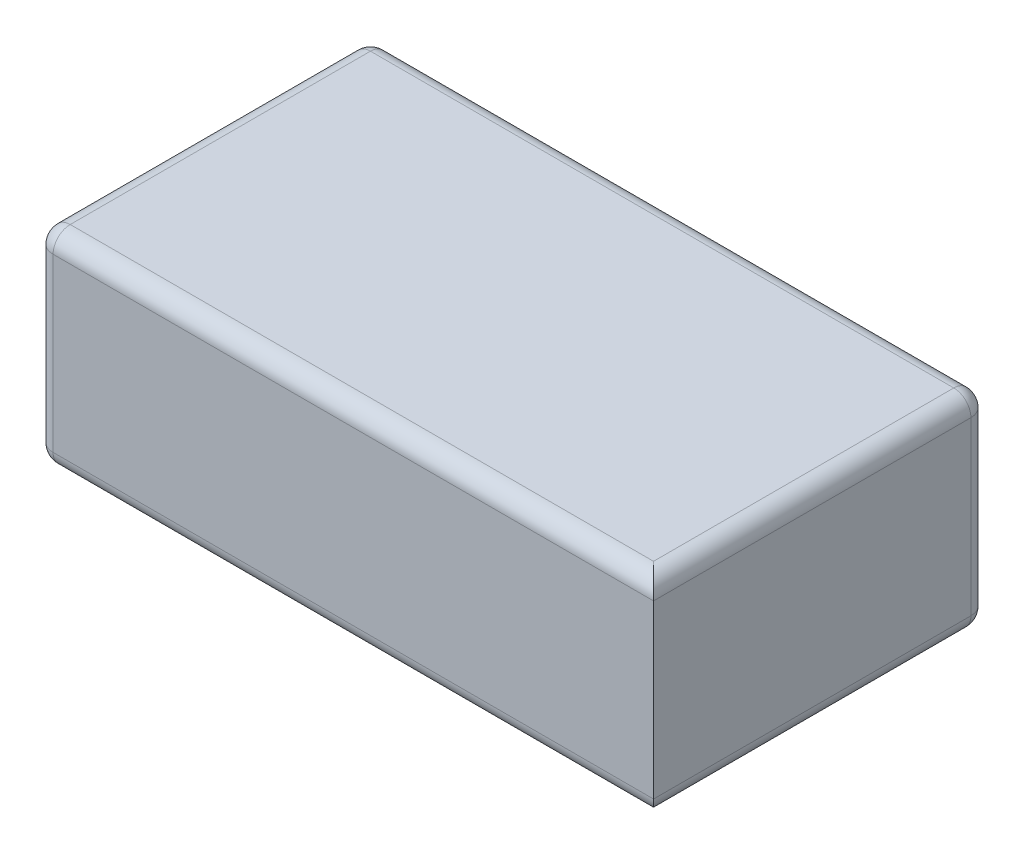
ISO-10303-21;
HEADER;
FILE_DESCRIPTION(('STEP AP214'),'2;1');
FILE_NAME('part.step','',(''),(''),'','','');
FILE_SCHEMA(('AUTOMOTIVE_DESIGN { 1 0 10303 214 1 1 1 1 }'));
ENDSEC;
DATA;
#1=APPLICATION_CONTEXT('core data for automotive mechanical design processes');
#2=APPLICATION_PROTOCOL_DEFINITION('international standard','automotive_design',2000,#1);
#3=PRODUCT_CONTEXT('',#1,'mechanical');
#4=PRODUCT('Part','Part','',(#3));
#5=PRODUCT_RELATED_PRODUCT_CATEGORY('part','',(#4));
#6=PRODUCT_DEFINITION_FORMATION('','',#4);
#7=PRODUCT_DEFINITION_CONTEXT('part definition',#1,'design');
#8=PRODUCT_DEFINITION('design','',#6,#7);
#9=PRODUCT_DEFINITION_SHAPE('','',#8);
#10=(LENGTH_UNIT() NAMED_UNIT(*) SI_UNIT(.MILLI.,.METRE.));
#11=(NAMED_UNIT(*) PLANE_ANGLE_UNIT() SI_UNIT($,.RADIAN.));
#12=(NAMED_UNIT(*) SI_UNIT($,.STERADIAN.) SOLID_ANGLE_UNIT());
#13=UNCERTAINTY_MEASURE_WITH_UNIT(LENGTH_MEASURE(1.E-05),#10,'distance_accuracy_value','');
#14=(GEOMETRIC_REPRESENTATION_CONTEXT(3) GLOBAL_UNCERTAINTY_ASSIGNED_CONTEXT((#13)) GLOBAL_UNIT_ASSIGNED_CONTEXT((#10,
#11,#12)) REPRESENTATION_CONTEXT('',''));
#15=CARTESIAN_POINT('',(0.,0.,0.));
#16=DIRECTION('',(0.,0.,1.));
#17=DIRECTION('',(1.,0.,0.));
#18=AXIS2_PLACEMENT_3D('',#15,#16,#17);
#19=CARTESIAN_POINT('',(0.,24.,0.));
#20=DIRECTION('',(1.,0.,0.));
#21=DIRECTION('',(0.,0.,-1.));
#22=AXIS2_PLACEMENT_3D('',#19,#20,#21);
#23=PLANE('',#22);
#24=DIRECTION('',(0.,-1.,0.));
#25=VECTOR('',#24,1.);
#26=CARTESIAN_POINT('',(0.,24.,-2.00000000000002));
#27=LINE('',#26,#25);
#28=CARTESIAN_POINT('',(0.,2.,-2.));
#29=VERTEX_POINT('',#28);
#30=CARTESIAN_POINT('',(0.,22.,-2.));
#31=VERTEX_POINT('',#30);
#32=EDGE_CURVE('E182',#29,#31,#27,.F.);
#33=ORIENTED_EDGE('',*,*,#32,.T.);
#34=DIRECTION('',(0.,0.,1.));
#35=VECTOR('',#34,1.);
#36=CARTESIAN_POINT('',(0.,22.,0.));
#37=LINE('',#36,#35);
#38=CARTESIAN_POINT('',(0.,21.9999999999999,-37.));
#39=VERTEX_POINT('',#38);
#40=EDGE_CURVE('E184',#31,#39,#37,.F.);
#41=ORIENTED_EDGE('',*,*,#40,.T.);
#42=DIRECTION('',(0.,-1.,0.));
#43=VECTOR('',#42,1.);
#44=CARTESIAN_POINT('',(0.,23.9999999999999,-37.));
#45=LINE('',#44,#43);
#46=CARTESIAN_POINT('',(0.,2.,-37.));
#47=VERTEX_POINT('',#46);
#48=EDGE_CURVE('E178',#39,#47,#45,.T.);
#49=ORIENTED_EDGE('',*,*,#48,.T.);
#50=DIRECTION('',(0.,0.,1.));
#51=VECTOR('',#50,1.);
#52=CARTESIAN_POINT('',(0.,2.,0.));
#53=LINE('',#52,#51);
#54=EDGE_CURVE('E180',#47,#29,#53,.T.);
#55=ORIENTED_EDGE('',*,*,#54,.T.);
#56=EDGE_LOOP('',(#33,#41,#49,#55));
#57=FACE_BOUND('',#56,.T.);
#58=ADVANCED_FACE('F36',(#57),#23,.F.);
#59=CARTESIAN_POINT('',(0.,24.,0.));
#60=DIRECTION('',(0.,0.,-1.));
#61=DIRECTION('',(-1.,0.,0.));
#62=AXIS2_PLACEMENT_3D('',#59,#60,#61);
#63=PLANE('',#62);
#64=DIRECTION('',(0.,-1.,0.));
#65=VECTOR('',#64,1.);
#66=CARTESIAN_POINT('',(1.99999999999998,24.,0.));
#67=LINE('',#66,#65);
#68=CARTESIAN_POINT('',(1.99999999999999,22.,0.));
#69=VERTEX_POINT('',#68);
#70=CARTESIAN_POINT('',(2.,2.,0.));
#71=VERTEX_POINT('',#70);
#72=EDGE_CURVE('E139',#69,#71,#67,.T.);
#73=ORIENTED_EDGE('',*,*,#72,.T.);
#74=DIRECTION('',(1.,0.,0.));
#75=VECTOR('',#74,1.);
#76=CARTESIAN_POINT('',(72.,2.,0.));
#77=LINE('',#76,#75);
#78=CARTESIAN_POINT('',(72.,2.,0.));
#79=VERTEX_POINT('',#78);
#80=EDGE_CURVE('E138',#71,#79,#77,.T.);
#81=ORIENTED_EDGE('',*,*,#80,.T.);
#82=DIRECTION('',(0.,-1.,0.));
#83=VECTOR('',#82,1.);
#84=CARTESIAN_POINT('',(72.,23.9999999999999,0.));
#85=LINE('',#84,#83);
#86=CARTESIAN_POINT('',(72.,21.9999999999999,0.));
#87=VERTEX_POINT('',#86);
#88=EDGE_CURVE('E122',#87,#79,#85,.T.);
#89=ORIENTED_EDGE('',*,*,#88,.F.);
#90=DIRECTION('',(1.,0.,0.));
#91=VECTOR('',#90,1.);
#92=CARTESIAN_POINT('',(0.,22.,0.));
#93=LINE('',#92,#91);
#94=EDGE_CURVE('E135',#87,#69,#93,.F.);
#95=ORIENTED_EDGE('',*,*,#94,.T.);
#96=EDGE_LOOP('',(#73,#81,#89,#95));
#97=FACE_BOUND('',#96,.T.);
#98=ADVANCED_FACE('F133',(#97),#63,.F.);
#99=CARTESIAN_POINT('',(72.,23.9999999999999,0.));
#100=DIRECTION('',(-1.,0.,0.));
#101=DIRECTION('',(0.,0.,1.));
#102=AXIS2_PLACEMENT_3D('',#99,#100,#101);
#103=PLANE('',#102);
#104=ORIENTED_EDGE('',*,*,#88,.T.);
#105=DIRECTION('',(0.,0.,-1.));
#106=VECTOR('',#105,1.);
#107=CARTESIAN_POINT('',(72.,2.,-39.));
#108=LINE('',#107,#106);
#109=CARTESIAN_POINT('',(72.,1.99999999999995,-37.));
#110=VERTEX_POINT('',#109);
#111=EDGE_CURVE('E129',#79,#110,#108,.T.);
#112=ORIENTED_EDGE('',*,*,#111,.T.);
#113=DIRECTION('',(0.,-1.,0.));
#114=VECTOR('',#113,1.);
#115=CARTESIAN_POINT('',(72.,23.9999999999999,-37.));
#116=LINE('',#115,#114);
#117=CARTESIAN_POINT('',(72.,21.9999999999999,-37.));
#118=VERTEX_POINT('',#117);
#119=EDGE_CURVE('E124',#110,#118,#116,.F.);
#120=ORIENTED_EDGE('',*,*,#119,.T.);
#121=DIRECTION('',(0.,0.,-1.));
#122=VECTOR('',#121,1.);
#123=CARTESIAN_POINT('',(72.,21.9999999999999,0.));
#124=LINE('',#123,#122);
#125=EDGE_CURVE('E119',#118,#87,#124,.F.);
#126=ORIENTED_EDGE('',*,*,#125,.T.);
#127=EDGE_LOOP('',(#104,#112,#120,#126));
#128=FACE_BOUND('',#127,.T.);
#129=ADVANCED_FACE('F121',(#128),#103,.F.);
#130=CARTESIAN_POINT('',(0.,23.9999999999999,-39.));
#131=DIRECTION('',(0.,0.,1.));
#132=DIRECTION('',(1.,0.,0.));
#133=AXIS2_PLACEMENT_3D('',#130,#131,#132);
#134=PLANE('',#133);
#135=DIRECTION('',(-1.,0.,0.));
#136=VECTOR('',#135,1.);
#137=CARTESIAN_POINT('',(0.,21.9999999999999,-39.));
#138=LINE('',#137,#136);
#139=CARTESIAN_POINT('',(2.,22.,-39.));
#140=VERTEX_POINT('',#139);
#141=CARTESIAN_POINT('',(70.,21.9999999999999,-39.));
#142=VERTEX_POINT('',#141);
#143=EDGE_CURVE('E45',#140,#142,#138,.F.);
#144=ORIENTED_EDGE('',*,*,#143,.T.);
#145=DIRECTION('',(0.,-1.,0.));
#146=VECTOR('',#145,1.);
#147=CARTESIAN_POINT('',(70.,23.9999999999999,-39.));
#148=LINE('',#147,#146);
#149=CARTESIAN_POINT('',(70.,2.,-39.));
#150=VERTEX_POINT('',#149);
#151=EDGE_CURVE('E11',#142,#150,#148,.T.);
#152=ORIENTED_EDGE('',*,*,#151,.T.);
#153=DIRECTION('',(-1.,0.,0.));
#154=VECTOR('',#153,1.);
#155=CARTESIAN_POINT('',(0.,2.,-39.));
#156=LINE('',#155,#154);
#157=CARTESIAN_POINT('',(2.,2.,-39.));
#158=VERTEX_POINT('',#157);
#159=EDGE_CURVE('E187',#150,#158,#156,.T.);
#160=ORIENTED_EDGE('',*,*,#159,.T.);
#161=DIRECTION('',(0.,-1.,0.));
#162=VECTOR('',#161,1.);
#163=CARTESIAN_POINT('',(2.,24.,-39.));
#164=LINE('',#163,#162);
#165=EDGE_CURVE('E56',#158,#140,#164,.F.);
#166=ORIENTED_EDGE('',*,*,#165,.T.);
#167=EDGE_LOOP('',(#144,#152,#160,#166));
#168=FACE_BOUND('',#167,.T.);
#169=ADVANCED_FACE('F251',(#168),#134,.F.);
#170=CARTESIAN_POINT('',(0.,23.9999999999999,-39.));
#171=DIRECTION('',(0.,-1.,0.));
#172=DIRECTION('',(0.,0.,-1.));
#173=AXIS2_PLACEMENT_3D('',#170,#171,#172);
#174=PLANE('',#173);
#175=DIRECTION('',(1.,0.,0.));
#176=VECTOR('',#175,1.);
#177=CARTESIAN_POINT('',(0.,24.,-2.00000000000002));
#178=LINE('',#177,#176);
#179=CARTESIAN_POINT('',(1.99999999999998,24.,-2.00000000000003));
#180=VERTEX_POINT('',#179);
#181=CARTESIAN_POINT('',(70.,23.9999999999999,-2.));
#182=VERTEX_POINT('',#181);
#183=EDGE_CURVE('E175',#180,#182,#178,.T.);
#184=ORIENTED_EDGE('',*,*,#183,.T.);
#185=DIRECTION('',(0.,0.,-1.));
#186=VECTOR('',#185,1.);
#187=CARTESIAN_POINT('',(70.,23.9999999999999,-39.));
#188=LINE('',#187,#186);
#189=CARTESIAN_POINT('',(70.,23.9999999999999,-37.));
#190=VERTEX_POINT('',#189);
#191=EDGE_CURVE('E146',#182,#190,#188,.T.);
#192=ORIENTED_EDGE('',*,*,#191,.T.);
#193=DIRECTION('',(-1.,0.,0.));
#194=VECTOR('',#193,1.);
#195=CARTESIAN_POINT('',(0.,23.9999999999999,-37.));
#196=LINE('',#195,#194);
#197=CARTESIAN_POINT('',(2.,23.9999999999999,-37.));
#198=VERTEX_POINT('',#197);
#199=EDGE_CURVE('E171',#190,#198,#196,.T.);
#200=ORIENTED_EDGE('',*,*,#199,.T.);
#201=DIRECTION('',(0.,0.,1.));
#202=VECTOR('',#201,1.);
#203=CARTESIAN_POINT('',(2.,24.,-39.));
#204=LINE('',#203,#202);
#205=EDGE_CURVE('E173',#198,#180,#204,.T.);
#206=ORIENTED_EDGE('',*,*,#205,.T.);
#207=EDGE_LOOP('',(#184,#192,#200,#206));
#208=FACE_BOUND('',#207,.T.);
#209=ADVANCED_FACE('F248',(#208),#174,.F.);
#210=CARTESIAN_POINT('',(0.,0.,-39.));
#211=DIRECTION('',(0.,-1.,0.));
#212=DIRECTION('',(0.,0.,-1.));
#213=AXIS2_PLACEMENT_3D('',#210,#211,#212);
#214=PLANE('',#213);
#215=DIRECTION('',(0.,0.,-1.));
#216=VECTOR('',#215,1.);
#217=CARTESIAN_POINT('',(70.,0.,0.));
#218=LINE('',#217,#216);
#219=CARTESIAN_POINT('',(70.,0.,-37.));
#220=VERTEX_POINT('',#219);
#221=CARTESIAN_POINT('',(70.,0.,-2.));
#222=VERTEX_POINT('',#221);
#223=EDGE_CURVE('E164',#220,#222,#218,.F.);
#224=ORIENTED_EDGE('',*,*,#223,.T.);
#225=DIRECTION('',(1.,0.,0.));
#226=VECTOR('',#225,1.);
#227=CARTESIAN_POINT('',(0.,0.,-2.00000000000001));
#228=LINE('',#227,#226);
#229=CARTESIAN_POINT('',(2.,0.,-2.00000000000001));
#230=VERTEX_POINT('',#229);
#231=EDGE_CURVE('E166',#222,#230,#228,.F.);
#232=ORIENTED_EDGE('',*,*,#231,.T.);
#233=DIRECTION('',(0.,0.,1.));
#234=VECTOR('',#233,1.);
#235=CARTESIAN_POINT('',(2.,0.,-39.));
#236=LINE('',#235,#234);
#237=CARTESIAN_POINT('',(2.,0.,-37.));
#238=VERTEX_POINT('',#237);
#239=EDGE_CURVE('E162',#230,#238,#236,.F.);
#240=ORIENTED_EDGE('',*,*,#239,.T.);
#241=DIRECTION('',(-1.,0.,0.));
#242=VECTOR('',#241,1.);
#243=CARTESIAN_POINT('',(72.,0.,-37.));
#244=LINE('',#243,#242);
#245=EDGE_CURVE('E157',#238,#220,#244,.F.);
#246=ORIENTED_EDGE('',*,*,#245,.T.);
#247=EDGE_LOOP('',(#224,#232,#240,#246));
#248=FACE_BOUND('',#247,.T.);
#249=ADVANCED_FACE('F250',(#248),#214,.T.);
#250=CARTESIAN_POINT('',(2.,21.9999999999999,-37.));
#251=DIRECTION('',(0.,0.,1.));
#252=DIRECTION('',(1.,0.,0.));
#253=AXIS2_PLACEMENT_3D('',#250,#251,#252);
#254=SPHERICAL_SURFACE('',#253,2.);
#255=CARTESIAN_POINT('',(2.,21.9999999999999,-37.));
#256=DIRECTION('',(0.,0.,-1.));
#257=DIRECTION('',(-1.,0.,0.));
#258=AXIS2_PLACEMENT_3D('',#255,#256,#257);
#259=CIRCLE('',#258,2.);
#260=EDGE_CURVE('E149',#198,#39,#259,.F.);
#261=ORIENTED_EDGE('',*,*,#260,.F.);
#262=CARTESIAN_POINT('',(2.,21.9999999999999,-37.));
#263=DIRECTION('',(-1.,0.,0.));
#264=DIRECTION('',(0.,0.,1.));
#265=AXIS2_PLACEMENT_3D('',#262,#263,#264);
#266=CIRCLE('',#265,2.);
#267=EDGE_CURVE('E40',#140,#198,#266,.F.);
#268=ORIENTED_EDGE('',*,*,#267,.F.);
#269=CARTESIAN_POINT('',(2.,21.9999999999999,-37.));
#270=DIRECTION('',(0.,1.,0.));
#271=DIRECTION('',(0.,0.,1.));
#272=AXIS2_PLACEMENT_3D('',#269,#270,#271);
#273=CIRCLE('',#272,2.);
#274=EDGE_CURVE('E232',#39,#140,#273,.F.);
#275=ORIENTED_EDGE('',*,*,#274,.F.);
#276=EDGE_LOOP('',(#261,#268,#275));
#277=FACE_BOUND('',#276,.T.);
#278=ADVANCED_FACE('F38',(#277),#254,.T.);
#279=CARTESIAN_POINT('',(70.,21.9999999999999,-39.));
#280=DIRECTION('',(0.,0.,-1.));
#281=DIRECTION('',(-1.,0.,0.));
#282=AXIS2_PLACEMENT_3D('',#279,#280,#281);
#283=CYLINDRICAL_SURFACE('',#282,2.);
#284=CARTESIAN_POINT('',(70.,21.9999999999999,-37.));
#285=DIRECTION('',(0.,0.,-1.));
#286=DIRECTION('',(-1.,0.,0.));
#287=AXIS2_PLACEMENT_3D('',#284,#285,#286);
#288=CIRCLE('',#287,2.);
#289=EDGE_CURVE('E150',#190,#118,#288,.T.);
#290=ORIENTED_EDGE('',*,*,#289,.F.);
#291=ORIENTED_EDGE('',*,*,#191,.F.);
#292=CARTESIAN_POINT('',(70.,21.9999999999999,-2.));
#293=DIRECTION('',(0.707106781186548,0.,-0.707106781186547));
#294=DIRECTION('',(0.707106781186547,0.,0.707106781186548));
#295=AXIS2_PLACEMENT_3D('',#292,#293,#294);
#296=ELLIPSE('',#295,2.82842712474619,2.);
#297=EDGE_CURVE('E143',#87,#182,#296,.F.);
#298=ORIENTED_EDGE('',*,*,#297,.F.);
#299=ORIENTED_EDGE('',*,*,#125,.F.);
#300=EDGE_LOOP('',(#290,#291,#298,#299));
#301=FACE_BOUND('',#300,.T.);
#302=ADVANCED_FACE('F144',(#301),#283,.T.);
#303=CARTESIAN_POINT('',(0.,21.9999999999999,-37.));
#304=DIRECTION('',(-1.,0.,0.));
#305=DIRECTION('',(0.,0.,1.));
#306=AXIS2_PLACEMENT_3D('',#303,#304,#305);
#307=CYLINDRICAL_SURFACE('',#306,2.);
#308=ORIENTED_EDGE('',*,*,#267,.T.);
#309=ORIENTED_EDGE('',*,*,#199,.F.);
#310=CARTESIAN_POINT('',(70.,21.9999999999999,-37.));
#311=DIRECTION('',(1.,0.,0.));
#312=DIRECTION('',(0.,0.,-1.));
#313=AXIS2_PLACEMENT_3D('',#310,#311,#312);
#314=CIRCLE('',#313,2.);
#315=EDGE_CURVE('E228',#142,#190,#314,.T.);
#316=ORIENTED_EDGE('',*,*,#315,.F.);
#317=ORIENTED_EDGE('',*,*,#143,.F.);
#318=EDGE_LOOP('',(#308,#309,#316,#317));
#319=FACE_BOUND('',#318,.T.);
#320=ADVANCED_FACE('F240',(#319),#307,.T.);
#321=CARTESIAN_POINT('',(2.,23.9999999999999,-37.));
#322=DIRECTION('',(0.,-1.,0.));
#323=DIRECTION('',(0.,0.,-1.));
#324=AXIS2_PLACEMENT_3D('',#321,#322,#323);
#325=CYLINDRICAL_SURFACE('',#324,2.);
#326=ORIENTED_EDGE('',*,*,#274,.T.);
#327=ORIENTED_EDGE('',*,*,#165,.F.);
#328=CARTESIAN_POINT('',(2.,1.99999999999995,-37.));
#329=DIRECTION('',(0.,-1.,0.));
#330=DIRECTION('',(0.,0.,-1.));
#331=AXIS2_PLACEMENT_3D('',#328,#329,#330);
#332=CIRCLE('',#331,2.);
#333=EDGE_CURVE('E225',#47,#158,#332,.T.);
#334=ORIENTED_EDGE('',*,*,#333,.F.);
#335=ORIENTED_EDGE('',*,*,#48,.F.);
#336=EDGE_LOOP('',(#326,#327,#334,#335));
#337=FACE_BOUND('',#336,.T.);
#338=ADVANCED_FACE('F317',(#337),#325,.T.);
#339=CARTESIAN_POINT('',(2.,22.,-39.));
#340=DIRECTION('',(0.,0.,1.));
#341=DIRECTION('',(1.,0.,0.));
#342=AXIS2_PLACEMENT_3D('',#339,#340,#341);
#343=CYLINDRICAL_SURFACE('',#342,2.);
#344=ORIENTED_EDGE('',*,*,#260,.T.);
#345=ORIENTED_EDGE('',*,*,#40,.F.);
#346=CARTESIAN_POINT('',(1.99999999999999,22.,-2.));
#347=DIRECTION('',(0.,0.,1.));
#348=DIRECTION('',(1.,0.,0.));
#349=AXIS2_PLACEMENT_3D('',#346,#347,#348);
#350=CIRCLE('',#349,2.);
#351=EDGE_CURVE('E222',#180,#31,#350,.T.);
#352=ORIENTED_EDGE('',*,*,#351,.F.);
#353=ORIENTED_EDGE('',*,*,#205,.F.);
#354=EDGE_LOOP('',(#344,#345,#352,#353));
#355=FACE_BOUND('',#354,.T.);
#356=ADVANCED_FACE('F246',(#355),#343,.T.);
#357=CARTESIAN_POINT('',(0.,22.,-2.));
#358=DIRECTION('',(1.,0.,0.));
#359=DIRECTION('',(0.,0.,-1.));
#360=AXIS2_PLACEMENT_3D('',#357,#358,#359);
#361=CYLINDRICAL_SURFACE('',#360,2.);
#362=ORIENTED_EDGE('',*,*,#297,.T.);
#363=ORIENTED_EDGE('',*,*,#183,.F.);
#364=CARTESIAN_POINT('',(1.99999999999999,22.,-2.));
#365=DIRECTION('',(-1.,0.,0.));
#366=DIRECTION('',(0.,0.,1.));
#367=AXIS2_PLACEMENT_3D('',#364,#365,#366);
#368=CIRCLE('',#367,2.);
#369=EDGE_CURVE('E154',#69,#180,#368,.T.);
#370=ORIENTED_EDGE('',*,*,#369,.F.);
#371=ORIENTED_EDGE('',*,*,#94,.F.);
#372=EDGE_LOOP('',(#362,#363,#370,#371));
#373=FACE_BOUND('',#372,.T.);
#374=ADVANCED_FACE('F152',(#373),#361,.T.);
#375=CARTESIAN_POINT('',(70.,21.9999999999999,-37.));
#376=DIRECTION('',(0.,0.,1.));
#377=DIRECTION('',(1.,0.,0.));
#378=AXIS2_PLACEMENT_3D('',#375,#376,#377);
#379=SPHERICAL_SURFACE('',#378,2.);
#380=ORIENTED_EDGE('',*,*,#315,.T.);
#381=ORIENTED_EDGE('',*,*,#289,.T.);
#382=CARTESIAN_POINT('',(70.,21.9999999999999,-37.));
#383=DIRECTION('',(0.,1.,0.));
#384=DIRECTION('',(0.,0.,1.));
#385=AXIS2_PLACEMENT_3D('',#382,#383,#384);
#386=CIRCLE('',#385,2.);
#387=EDGE_CURVE('E218',#142,#118,#386,.F.);
#388=ORIENTED_EDGE('',*,*,#387,.F.);
#389=EDGE_LOOP('',(#380,#381,#388));
#390=FACE_BOUND('',#389,.T.);
#391=ADVANCED_FACE('F308',(#390),#379,.T.);
#392=CARTESIAN_POINT('',(2.,1.99999999999995,-37.));
#393=DIRECTION('',(0.,0.,1.));
#394=DIRECTION('',(1.,0.,0.));
#395=AXIS2_PLACEMENT_3D('',#392,#393,#394);
#396=SPHERICAL_SURFACE('',#395,2.);
#397=CARTESIAN_POINT('',(2.,1.99999999999995,-37.));
#398=DIRECTION('',(0.,0.,-1.));
#399=DIRECTION('',(-1.,0.,0.));
#400=AXIS2_PLACEMENT_3D('',#397,#398,#399);
#401=CIRCLE('',#400,2.);
#402=EDGE_CURVE('E212',#47,#238,#401,.F.);
#403=ORIENTED_EDGE('',*,*,#402,.F.);
#404=ORIENTED_EDGE('',*,*,#333,.T.);
#405=CARTESIAN_POINT('',(2.,1.99999999999995,-37.));
#406=DIRECTION('',(-1.,0.,0.));
#407=DIRECTION('',(0.,0.,1.));
#408=AXIS2_PLACEMENT_3D('',#405,#406,#407);
#409=CIRCLE('',#408,2.);
#410=EDGE_CURVE('E215',#238,#158,#409,.F.);
#411=ORIENTED_EDGE('',*,*,#410,.F.);
#412=EDGE_LOOP('',(#403,#404,#411));
#413=FACE_BOUND('',#412,.T.);
#414=ADVANCED_FACE('F304',(#413),#396,.T.);
#415=CARTESIAN_POINT('',(1.99999999999999,22.,-2.));
#416=DIRECTION('',(0.,0.,1.));
#417=DIRECTION('',(1.,0.,0.));
#418=AXIS2_PLACEMENT_3D('',#415,#416,#417);
#419=SPHERICAL_SURFACE('',#418,2.);
#420=ORIENTED_EDGE('',*,*,#369,.T.);
#421=ORIENTED_EDGE('',*,*,#351,.T.);
#422=CARTESIAN_POINT('',(1.99999999999999,22.,-2.));
#423=DIRECTION('',(0.,1.,0.));
#424=DIRECTION('',(0.,0.,1.));
#425=AXIS2_PLACEMENT_3D('',#422,#423,#424);
#426=CIRCLE('',#425,2.);
#427=EDGE_CURVE('E209',#69,#31,#426,.F.);
#428=ORIENTED_EDGE('',*,*,#427,.F.);
#429=EDGE_LOOP('',(#420,#421,#428));
#430=FACE_BOUND('',#429,.T.);
#431=ADVANCED_FACE('F300',(#430),#419,.T.);
#432=CARTESIAN_POINT('',(70.,23.9999999999999,-37.));
#433=DIRECTION('',(0.,-1.,0.));
#434=DIRECTION('',(0.,0.,-1.));
#435=AXIS2_PLACEMENT_3D('',#432,#433,#434);
#436=CYLINDRICAL_SURFACE('',#435,2.);
#437=ORIENTED_EDGE('',*,*,#387,.T.);
#438=ORIENTED_EDGE('',*,*,#119,.F.);
#439=CARTESIAN_POINT('',(70.,2.,-37.));
#440=DIRECTION('',(0.,-1.,0.));
#441=DIRECTION('',(0.,0.,-1.));
#442=AXIS2_PLACEMENT_3D('',#439,#440,#441);
#443=CIRCLE('',#442,2.);
#444=EDGE_CURVE('E206',#150,#110,#443,.T.);
#445=ORIENTED_EDGE('',*,*,#444,.F.);
#446=ORIENTED_EDGE('',*,*,#151,.F.);
#447=EDGE_LOOP('',(#437,#438,#445,#446));
#448=FACE_BOUND('',#447,.T.);
#449=ADVANCED_FACE('F296',(#448),#436,.T.);
#450=CARTESIAN_POINT('',(0.,2.,-37.));
#451=DIRECTION('',(1.,0.,0.));
#452=DIRECTION('',(0.,0.,-1.));
#453=AXIS2_PLACEMENT_3D('',#450,#451,#452);
#454=CYLINDRICAL_SURFACE('',#453,2.);
#455=ORIENTED_EDGE('',*,*,#410,.T.);
#456=ORIENTED_EDGE('',*,*,#159,.F.);
#457=CARTESIAN_POINT('',(70.,2.,-37.));
#458=DIRECTION('',(1.,0.,0.));
#459=DIRECTION('',(0.,0.,-1.));
#460=AXIS2_PLACEMENT_3D('',#457,#458,#459);
#461=CIRCLE('',#460,2.);
#462=EDGE_CURVE('E204',#220,#150,#461,.T.);
#463=ORIENTED_EDGE('',*,*,#462,.F.);
#464=ORIENTED_EDGE('',*,*,#245,.F.);
#465=EDGE_LOOP('',(#455,#456,#463,#464));
#466=FACE_BOUND('',#465,.T.);
#467=ADVANCED_FACE('F292',(#466),#454,.T.);
#468=CARTESIAN_POINT('',(2.,2.,0.));
#469=DIRECTION('',(0.,0.,-1.));
#470=DIRECTION('',(-1.,0.,0.));
#471=AXIS2_PLACEMENT_3D('',#468,#469,#470);
#472=CYLINDRICAL_SURFACE('',#471,2.);
#473=ORIENTED_EDGE('',*,*,#402,.T.);
#474=ORIENTED_EDGE('',*,*,#239,.F.);
#475=CARTESIAN_POINT('',(2.,1.99999999999995,-2.00000000000002));
#476=DIRECTION('',(0.,0.,1.));
#477=DIRECTION('',(1.,0.,0.));
#478=AXIS2_PLACEMENT_3D('',#475,#476,#477);
#479=CIRCLE('',#478,2.);
#480=EDGE_CURVE('E201',#29,#230,#479,.T.);
#481=ORIENTED_EDGE('',*,*,#480,.F.);
#482=ORIENTED_EDGE('',*,*,#54,.F.);
#483=EDGE_LOOP('',(#473,#474,#481,#482));
#484=FACE_BOUND('',#483,.T.);
#485=ADVANCED_FACE('F288',(#484),#472,.T.);
#486=CARTESIAN_POINT('',(1.99999999999998,24.,-2.00000000000002));
#487=DIRECTION('',(0.,-1.,0.));
#488=DIRECTION('',(0.,0.,-1.));
#489=AXIS2_PLACEMENT_3D('',#486,#487,#488);
#490=CYLINDRICAL_SURFACE('',#489,2.);
#491=ORIENTED_EDGE('',*,*,#427,.T.);
#492=ORIENTED_EDGE('',*,*,#32,.F.);
#493=CARTESIAN_POINT('',(2.,1.99999999999995,-2.00000000000002));
#494=DIRECTION('',(0.,-1.,0.));
#495=DIRECTION('',(0.,0.,-1.));
#496=AXIS2_PLACEMENT_3D('',#493,#494,#495);
#497=CIRCLE('',#496,2.);
#498=EDGE_CURVE('E198',#71,#29,#497,.T.);
#499=ORIENTED_EDGE('',*,*,#498,.F.);
#500=ORIENTED_EDGE('',*,*,#72,.F.);
#501=EDGE_LOOP('',(#491,#492,#499,#500));
#502=FACE_BOUND('',#501,.T.);
#503=ADVANCED_FACE('F284',(#502),#490,.T.);
#504=CARTESIAN_POINT('',(70.,2.,-37.));
#505=DIRECTION('',(0.,0.,1.));
#506=DIRECTION('',(1.,0.,0.));
#507=AXIS2_PLACEMENT_3D('',#504,#505,#506);
#508=SPHERICAL_SURFACE('',#507,2.);
#509=ORIENTED_EDGE('',*,*,#462,.T.);
#510=ORIENTED_EDGE('',*,*,#444,.T.);
#511=CARTESIAN_POINT('',(70.,2.,-37.));
#512=DIRECTION('',(0.,0.,-1.));
#513=DIRECTION('',(-1.,0.,0.));
#514=AXIS2_PLACEMENT_3D('',#511,#512,#513);
#515=CIRCLE('',#514,2.);
#516=EDGE_CURVE('E195',#220,#110,#515,.F.);
#517=ORIENTED_EDGE('',*,*,#516,.F.);
#518=EDGE_LOOP('',(#509,#510,#517));
#519=FACE_BOUND('',#518,.T.);
#520=ADVANCED_FACE('F280',(#519),#508,.T.);
#521=CARTESIAN_POINT('',(2.,1.99999999999995,-2.00000000000002));
#522=DIRECTION('',(0.,0.,1.));
#523=DIRECTION('',(1.,0.,0.));
#524=AXIS2_PLACEMENT_3D('',#521,#522,#523);
#525=SPHERICAL_SURFACE('',#524,2.);
#526=ORIENTED_EDGE('',*,*,#498,.T.);
#527=ORIENTED_EDGE('',*,*,#480,.T.);
#528=CARTESIAN_POINT('',(2.,1.99999999999995,-2.00000000000002));
#529=DIRECTION('',(-1.,0.,0.));
#530=DIRECTION('',(0.,0.,1.));
#531=AXIS2_PLACEMENT_3D('',#528,#529,#530);
#532=CIRCLE('',#531,2.);
#533=EDGE_CURVE('E193',#71,#230,#532,.F.);
#534=ORIENTED_EDGE('',*,*,#533,.F.);
#535=EDGE_LOOP('',(#526,#527,#534));
#536=FACE_BOUND('',#535,.T.);
#537=ADVANCED_FACE('F276',(#536),#525,.T.);
#538=CARTESIAN_POINT('',(70.,1.99999999999995,0.));
#539=DIRECTION('',(0.,0.,1.));
#540=DIRECTION('',(1.,0.,0.));
#541=AXIS2_PLACEMENT_3D('',#538,#539,#540);
#542=CYLINDRICAL_SURFACE('',#541,2.);
#543=ORIENTED_EDGE('',*,*,#516,.T.);
#544=ORIENTED_EDGE('',*,*,#111,.F.);
#545=CARTESIAN_POINT('',(70.,2.,-1.99999999999999));
#546=DIRECTION('',(-0.707106781186548,0.,0.707106781186547));
#547=DIRECTION('',(0.707106781186547,0.,0.707106781186548));
#548=AXIS2_PLACEMENT_3D('',#545,#546,#547);
#549=ELLIPSE('',#548,2.82842712474619,2.);
#550=EDGE_CURVE('E191',#222,#79,#549,.T.);
#551=ORIENTED_EDGE('',*,*,#550,.F.);
#552=ORIENTED_EDGE('',*,*,#223,.F.);
#553=EDGE_LOOP('',(#543,#544,#551,#552));
#554=FACE_BOUND('',#553,.T.);
#555=ADVANCED_FACE('F272',(#554),#542,.T.);
#556=CARTESIAN_POINT('',(0.,2.,-2.));
#557=DIRECTION('',(-1.,0.,0.));
#558=DIRECTION('',(0.,0.,1.));
#559=AXIS2_PLACEMENT_3D('',#556,#557,#558);
#560=CYLINDRICAL_SURFACE('',#559,2.);
#561=ORIENTED_EDGE('',*,*,#533,.T.);
#562=ORIENTED_EDGE('',*,*,#231,.F.);
#563=ORIENTED_EDGE('',*,*,#550,.T.);
#564=ORIENTED_EDGE('',*,*,#80,.F.);
#565=EDGE_LOOP('',(#561,#562,#563,#564));
#566=FACE_BOUND('',#565,.T.);
#567=ADVANCED_FACE('F269',(#566),#560,.T.);
#568=CLOSED_SHELL('',(#58,#98,#129,#169,#209,#249,#278,#302,#320,#338,#356,#374,#391,#414,#431,
#449,#467,#485,#503,#520,#537,#555,#567));
#569=MANIFOLD_SOLID_BREP('B2',#568);
#570=ADVANCED_BREP_SHAPE_REPRESENTATION('',(#18,#569),#14);
#571=SHAPE_DEFINITION_REPRESENTATION(#9,#570);
ENDSEC;
END-ISO-10303-21;
